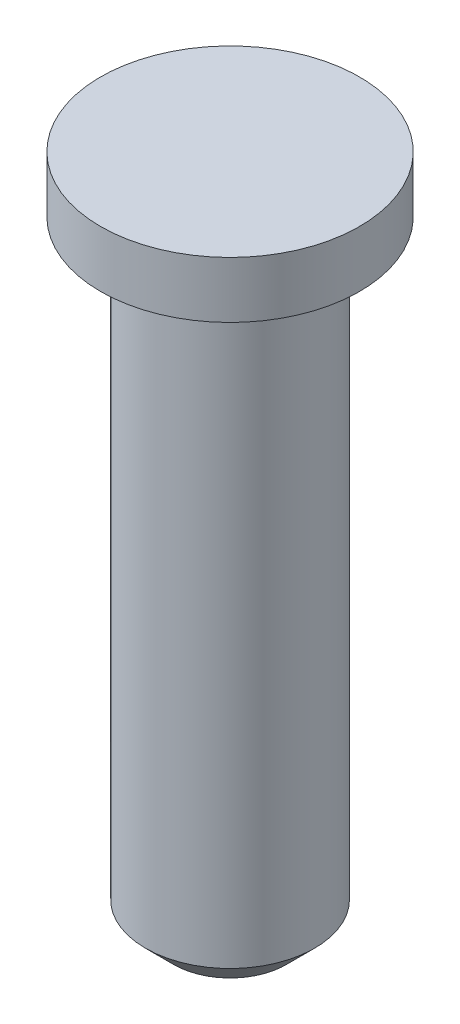
ISO-10303-21;
HEADER;
FILE_DESCRIPTION(('STEP AP214'),'2;1');
FILE_NAME('part.step','',(''),(''),'','','');
FILE_SCHEMA(('AUTOMOTIVE_DESIGN { 1 0 10303 214 1 1 1 1 }'));
ENDSEC;
DATA;
#1=APPLICATION_CONTEXT('core data for automotive mechanical design processes');
#2=APPLICATION_PROTOCOL_DEFINITION('international standard','automotive_design',2000,#1);
#3=PRODUCT_CONTEXT('',#1,'mechanical');
#4=PRODUCT('Part','Part','',(#3));
#5=PRODUCT_RELATED_PRODUCT_CATEGORY('part','',(#4));
#6=PRODUCT_DEFINITION_FORMATION('','',#4);
#7=PRODUCT_DEFINITION_CONTEXT('part definition',#1,'design');
#8=PRODUCT_DEFINITION('design','',#6,#7);
#9=PRODUCT_DEFINITION_SHAPE('','',#8);
#10=(LENGTH_UNIT() NAMED_UNIT(*) SI_UNIT(.MILLI.,.METRE.));
#11=(NAMED_UNIT(*) PLANE_ANGLE_UNIT() SI_UNIT($,.RADIAN.));
#12=(NAMED_UNIT(*) SI_UNIT($,.STERADIAN.) SOLID_ANGLE_UNIT());
#13=UNCERTAINTY_MEASURE_WITH_UNIT(LENGTH_MEASURE(1.E-05),#10,'distance_accuracy_value','');
#14=(GEOMETRIC_REPRESENTATION_CONTEXT(3) GLOBAL_UNCERTAINTY_ASSIGNED_CONTEXT((#13)) GLOBAL_UNIT_ASSIGNED_CONTEXT((#10,
#11,#12)) REPRESENTATION_CONTEXT('',''));
#15=CARTESIAN_POINT('',(0.,0.,0.));
#16=DIRECTION('',(0.,0.,1.));
#17=DIRECTION('',(1.,0.,0.));
#18=AXIS2_PLACEMENT_3D('',#15,#16,#17);
#19=CARTESIAN_POINT('',(0.,0.,0.));
#20=DIRECTION('',(0.,-1.,0.));
#21=DIRECTION('',(0.,0.,-1.));
#22=AXIS2_PLACEMENT_3D('',#19,#20,#21);
#23=PLANE('',#22);
#24=CARTESIAN_POINT('',(0.,0.,0.));
#25=DIRECTION('',(0.,1.,0.));
#26=DIRECTION('',(0.,0.,1.));
#27=AXIS2_PLACEMENT_3D('',#24,#25,#26);
#28=CIRCLE('',#27,2.3);
#29=CARTESIAN_POINT('',(0.,0.,2.3));
#30=VERTEX_POINT('',#29);
#31=EDGE_CURVE('E42',#30,#30,#28,.T.);
#32=ORIENTED_EDGE('',*,*,#31,.T.);
#33=EDGE_LOOP('',(#32));
#34=FACE_BOUND('',#33,.T.);
#35=ADVANCED_FACE('F31',(#34),#23,.F.);
#36=CARTESIAN_POINT('',(0.,0.,0.));
#37=DIRECTION('',(0.,1.,0.));
#38=DIRECTION('',(0.,0.,1.));
#39=AXIS2_PLACEMENT_3D('',#36,#37,#38);
#40=CYLINDRICAL_SURFACE('',#39,2.3);
#41=ORIENTED_EDGE('',*,*,#31,.F.);
#42=EDGE_LOOP('',(#41));
#43=FACE_BOUND('',#42,.T.);
#44=CARTESIAN_POINT('',(0.,-1.,0.));
#45=DIRECTION('',(0.,1.,0.));
#46=DIRECTION('',(0.,0.,1.));
#47=AXIS2_PLACEMENT_3D('',#44,#45,#46);
#48=CIRCLE('',#47,2.3);
#49=CARTESIAN_POINT('',(0.,-1.,2.3));
#50=VERTEX_POINT('',#49);
#51=EDGE_CURVE('E46',#50,#50,#48,.T.);
#52=ORIENTED_EDGE('',*,*,#51,.T.);
#53=EDGE_LOOP('',(#52));
#54=FACE_BOUND('',#53,.T.);
#55=ADVANCED_FACE('F66',(#43,#54),#40,.T.);
#56=CARTESIAN_POINT('',(2.3,-1.,0.));
#57=DIRECTION('',(0.,1.,0.));
#58=DIRECTION('',(0.,0.,1.));
#59=AXIS2_PLACEMENT_3D('',#56,#57,#58);
#60=PLANE('',#59);
#61=ORIENTED_EDGE('',*,*,#51,.F.);
#62=EDGE_LOOP('',(#61));
#63=FACE_BOUND('',#62,.T.);
#64=CARTESIAN_POINT('',(0.,-1.,0.));
#65=DIRECTION('',(0.,1.,0.));
#66=DIRECTION('',(0.,0.,1.));
#67=AXIS2_PLACEMENT_3D('',#64,#65,#66);
#68=CIRCLE('',#67,1.5);
#69=CARTESIAN_POINT('',(0.,-1.,1.5));
#70=VERTEX_POINT('',#69);
#71=EDGE_CURVE('E51',#70,#70,#68,.T.);
#72=ORIENTED_EDGE('',*,*,#71,.T.);
#73=EDGE_LOOP('',(#72));
#74=FACE_BOUND('',#73,.T.);
#75=ADVANCED_FACE('F55',(#63,#74),#60,.F.);
#76=CARTESIAN_POINT('',(0.,0.,0.));
#77=DIRECTION('',(0.,1.,0.));
#78=DIRECTION('',(0.,0.,1.));
#79=AXIS2_PLACEMENT_3D('',#76,#77,#78);
#80=CYLINDRICAL_SURFACE('',#79,1.5);
#81=CARTESIAN_POINT('',(0.,-11.5,0.));
#82=DIRECTION('',(0.,1.,0.));
#83=DIRECTION('',(0.,0.,1.));
#84=AXIS2_PLACEMENT_3D('',#81,#82,#83);
#85=CIRCLE('',#84,1.5);
#86=CARTESIAN_POINT('',(0.,-11.5,1.5));
#87=VERTEX_POINT('',#86);
#88=EDGE_CURVE('E38',#87,#87,#85,.T.);
#89=ORIENTED_EDGE('',*,*,#88,.T.);
#90=EDGE_LOOP('',(#89));
#91=FACE_BOUND('',#90,.T.);
#92=ORIENTED_EDGE('',*,*,#71,.F.);
#93=EDGE_LOOP('',(#92));
#94=FACE_BOUND('',#93,.T.);
#95=ADVANCED_FACE('F57',(#91,#94),#80,.T.);
#96=CARTESIAN_POINT('',(1.5,-12.,0.));
#97=DIRECTION('',(0.,1.,0.));
#98=DIRECTION('',(0.,0.,1.));
#99=AXIS2_PLACEMENT_3D('',#96,#97,#98);
#100=PLANE('',#99);
#101=CARTESIAN_POINT('',(0.,-12.,0.));
#102=DIRECTION('',(0.,1.,0.));
#103=DIRECTION('',(0.,0.,1.));
#104=AXIS2_PLACEMENT_3D('',#101,#102,#103);
#105=CIRCLE('',#104,0.999999999999999);
#106=CARTESIAN_POINT('',(0.,-12.,0.999999999999999));
#107=VERTEX_POINT('',#106);
#108=EDGE_CURVE('E10',#107,#107,#105,.F.);
#109=ORIENTED_EDGE('',*,*,#108,.T.);
#110=EDGE_LOOP('',(#109));
#111=FACE_BOUND('',#110,.T.);
#112=ADVANCED_FACE('F59',(#111),#100,.F.);
#113=CARTESIAN_POINT('',(0.,-11.5,0.));
#114=DIRECTION('',(0.,1.,0.));
#115=DIRECTION('',(0.,0.,1.));
#116=AXIS2_PLACEMENT_3D('',#113,#114,#115);
#117=CONICAL_SURFACE('',#116,1.5,0.785398163397449);
#118=ORIENTED_EDGE('',*,*,#108,.F.);
#119=EDGE_LOOP('',(#118));
#120=FACE_BOUND('',#119,.T.);
#121=ORIENTED_EDGE('',*,*,#88,.F.);
#122=EDGE_LOOP('',(#121));
#123=FACE_BOUND('',#122,.T.);
#124=ADVANCED_FACE('F33',(#120,#123),#117,.T.);
#125=CLOSED_SHELL('',(#35,#55,#75,#95,#112,#124));
#126=MANIFOLD_SOLID_BREP('B2',#125);
#127=ADVANCED_BREP_SHAPE_REPRESENTATION('',(#18,#126),#14);
#128=SHAPE_DEFINITION_REPRESENTATION(#9,#127);
ENDSEC;
END-ISO-10303-21;
